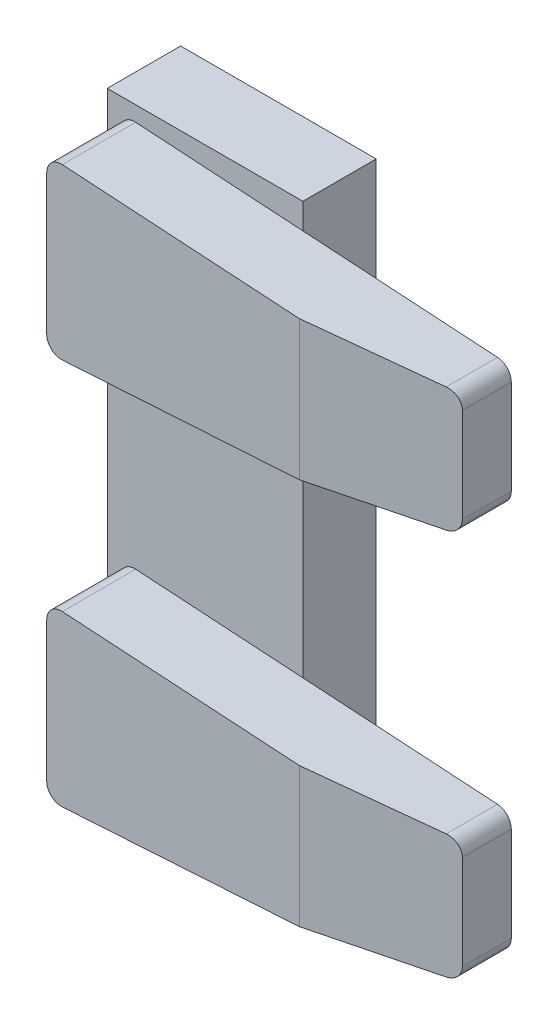
ISO-10303-21;
HEADER;
FILE_DESCRIPTION(('STEP AP214'),'2;1');
FILE_NAME('part.step','',(''),(''),'','','');
FILE_SCHEMA(('AUTOMOTIVE_DESIGN { 1 0 10303 214 1 1 1 1 }'));
ENDSEC;
DATA;
#1=APPLICATION_CONTEXT('core data for automotive mechanical design processes');
#2=APPLICATION_PROTOCOL_DEFINITION('international standard','automotive_design',2000,#1);
#3=PRODUCT_CONTEXT('',#1,'mechanical');
#4=PRODUCT('Part','Part','',(#3));
#5=PRODUCT_RELATED_PRODUCT_CATEGORY('part','',(#4));
#6=PRODUCT_DEFINITION_FORMATION('','',#4);
#7=PRODUCT_DEFINITION_CONTEXT('part definition',#1,'design');
#8=PRODUCT_DEFINITION('design','',#6,#7);
#9=PRODUCT_DEFINITION_SHAPE('','',#8);
#10=(LENGTH_UNIT() NAMED_UNIT(*) SI_UNIT(.MILLI.,.METRE.));
#11=(NAMED_UNIT(*) PLANE_ANGLE_UNIT() SI_UNIT($,.RADIAN.));
#12=(NAMED_UNIT(*) SI_UNIT($,.STERADIAN.) SOLID_ANGLE_UNIT());
#13=UNCERTAINTY_MEASURE_WITH_UNIT(LENGTH_MEASURE(1.E-05),#10,'distance_accuracy_value','');
#14=(GEOMETRIC_REPRESENTATION_CONTEXT(3) GLOBAL_UNCERTAINTY_ASSIGNED_CONTEXT((#13)) GLOBAL_UNIT_ASSIGNED_CONTEXT((#10,
#11,#12)) REPRESENTATION_CONTEXT('',''));
#15=CARTESIAN_POINT('',(0.,0.,0.));
#16=DIRECTION('',(0.,0.,1.));
#17=DIRECTION('',(1.,0.,0.));
#18=AXIS2_PLACEMENT_3D('',#15,#16,#17);
#19=CARTESIAN_POINT('',(37.3650708072044,332.353227073887,30.));
#20=DIRECTION('',(-0.0623782861551806,-0.998052578482889,0.));
#21=DIRECTION('',(0.998052578482889,-0.0623782861551806,0.));
#22=AXIS2_PLACEMENT_3D('',#19,#20,#21);
#23=PLANE('',#22);
#24=DIRECTION('',(-0.998052578482889,0.0623782861551806,0.));
#25=VECTOR('',#24,1.);
#26=CARTESIAN_POINT('',(37.3650708072044,332.353227073887,15.));
#27=LINE('',#26,#25);
#28=CARTESIAN_POINT('',(34.5522056656699,332.529031145233,15.));
#29=VERTEX_POINT('',#28);
#30=CARTESIAN_POINT('',(-39.4477943343301,337.154031145233,15.));
#31=VERTEX_POINT('',#30);
#32=EDGE_CURVE('E152',#29,#31,#27,.T.);
#33=ORIENTED_EDGE('',*,*,#32,.T.);
#34=DIRECTION('',(0.,0.,-1.));
#35=VECTOR('',#34,1.);
#36=CARTESIAN_POINT('',(-39.4477943343301,337.154031145233,30.));
#37=LINE('',#36,#35);
#38=CARTESIAN_POINT('',(-39.4477943343301,337.154031145233,30.));
#39=VERTEX_POINT('',#38);
#40=EDGE_CURVE('E143',#31,#39,#37,.F.);
#41=ORIENTED_EDGE('',*,*,#40,.T.);
#42=DIRECTION('',(-0.998052578482889,0.0623782861551806,0.));
#43=VECTOR('',#42,1.);
#44=CARTESIAN_POINT('',(37.3650708072044,332.353227073887,30.));
#45=LINE('',#44,#43);
#46=CARTESIAN_POINT('',(9.00866170911599,334.125502642518,30.));
#47=VERTEX_POINT('',#46);
#48=EDGE_CURVE('E135',#47,#39,#45,.T.);
#49=ORIENTED_EDGE('',*,*,#48,.F.);
#50=DIRECTION('',(0.982947583285047,-0.0614342239553155,-0.173320179555336));
#51=VECTOR('',#50,1.);
#52=CARTESIAN_POINT('',(29.1853721270141,332.864458241399,26.442301571383));
#53=LINE('',#52,#51);
#54=CARTESIAN_POINT('',(34.5522056656699,332.529031145233,25.4959840175469));
#55=VERTEX_POINT('',#54);
#56=EDGE_CURVE('E120',#47,#55,#53,.T.);
#57=ORIENTED_EDGE('',*,*,#56,.T.);
#58=DIRECTION('',(0.,0.,-1.));
#59=VECTOR('',#58,1.);
#60=CARTESIAN_POINT('',(34.5522056656699,332.529031145233,30.));
#61=LINE('',#60,#59);
#62=EDGE_CURVE('E184',#55,#29,#61,.T.);
#63=ORIENTED_EDGE('',*,*,#62,.T.);
#64=EDGE_LOOP('',(#33,#41,#49,#57,#63));
#65=FACE_BOUND('',#64,.T.);
#66=ADVANCED_FACE('F50',(#65),#23,.F.);
#67=CARTESIAN_POINT('',(-42.6349291927957,337.353227073887,30.));
#68=DIRECTION('',(1.,0.,0.));
#69=DIRECTION('',(0.,0.,-1.));
#70=AXIS2_PLACEMENT_3D('',#67,#68,#69);
#71=PLANE('',#70);
#72=DIRECTION('',(0.,-1.,0.));
#73=VECTOR('',#72,1.);
#74=CARTESIAN_POINT('',(-42.6349291927957,337.353227073887,15.));
#75=LINE('',#74,#73);
#76=CARTESIAN_POINT('',(-42.6349291927957,334.159873409784,15.));
#77=VERTEX_POINT('',#76);
#78=CARTESIAN_POINT('',(-42.6349291927957,305.54658073799,15.));
#79=VERTEX_POINT('',#78);
#80=EDGE_CURVE('E154',#77,#79,#75,.T.);
#81=ORIENTED_EDGE('',*,*,#80,.T.);
#82=DIRECTION('',(0.,0.,-1.));
#83=VECTOR('',#82,1.);
#84=CARTESIAN_POINT('',(-42.6349291927957,305.54658073799,30.));
#85=LINE('',#84,#83);
#86=CARTESIAN_POINT('',(-42.6349291927957,305.54658073799,30.));
#87=VERTEX_POINT('',#86);
#88=EDGE_CURVE('E178',#79,#87,#85,.F.);
#89=ORIENTED_EDGE('',*,*,#88,.T.);
#90=DIRECTION('',(0.,-1.,0.));
#91=VECTOR('',#90,1.);
#92=CARTESIAN_POINT('',(-42.6349291927957,337.353227073887,30.));
#93=LINE('',#92,#91);
#94=CARTESIAN_POINT('',(-42.6349291927957,334.159873409784,30.));
#95=VERTEX_POINT('',#94);
#96=EDGE_CURVE('E144',#95,#87,#93,.T.);
#97=ORIENTED_EDGE('',*,*,#96,.F.);
#98=DIRECTION('',(0.,0.,-1.));
#99=VECTOR('',#98,1.);
#100=CARTESIAN_POINT('',(-42.6349291927957,334.159873409784,30.));
#101=LINE('',#100,#99);
#102=EDGE_CURVE('E175',#95,#77,#101,.T.);
#103=ORIENTED_EDGE('',*,*,#102,.T.);
#104=EDGE_LOOP('',(#81,#89,#97,#103));
#105=FACE_BOUND('',#104,.T.);
#106=ADVANCED_FACE('F206',(#105),#71,.F.);
#107=CARTESIAN_POINT('',(-42.6349291927957,302.353227073887,30.));
#108=DIRECTION('',(-0.0623782861551806,0.998052578482889,0.));
#109=DIRECTION('',(-0.998052578482889,-0.0623782861551806,0.));
#110=AXIS2_PLACEMENT_3D('',#107,#108,#109);
#111=PLANE('',#110);
#112=DIRECTION('',(0.998052578482889,0.0623782861551806,0.));
#113=VECTOR('',#112,1.);
#114=CARTESIAN_POINT('',(-42.6349291927957,302.353227073887,30.));
#115=LINE('',#114,#113);
#116=CARTESIAN_POINT('',(-39.4477943343301,302.552423002541,30.));
#117=VERTEX_POINT('',#116);
#118=CARTESIAN_POINT('',(9.00866170911599,305.580951505257,30.));
#119=VERTEX_POINT('',#118);
#120=EDGE_CURVE('E138',#117,#119,#115,.T.);
#121=ORIENTED_EDGE('',*,*,#120,.F.);
#122=DIRECTION('',(0.,0.,-1.));
#123=VECTOR('',#122,1.);
#124=CARTESIAN_POINT('',(-39.4477943343301,302.552423002541,30.));
#125=LINE('',#124,#123);
#126=CARTESIAN_POINT('',(-39.4477943343301,302.552423002541,15.));
#127=VERTEX_POINT('',#126);
#128=EDGE_CURVE('E164',#117,#127,#125,.T.);
#129=ORIENTED_EDGE('',*,*,#128,.T.);
#130=DIRECTION('',(0.998052578482889,0.0623782861551806,0.));
#131=VECTOR('',#130,1.);
#132=CARTESIAN_POINT('',(-42.6349291927957,302.353227073887,15.));
#133=LINE('',#132,#131);
#134=CARTESIAN_POINT('',(34.5522056656699,307.177423002541,15.));
#135=VERTEX_POINT('',#134);
#136=EDGE_CURVE('E148',#127,#135,#133,.T.);
#137=ORIENTED_EDGE('',*,*,#136,.T.);
#138=DIRECTION('',(0.,0.,-1.));
#139=VECTOR('',#138,1.);
#140=CARTESIAN_POINT('',(34.5522056656699,307.177423002541,30.));
#141=LINE('',#140,#139);
#142=CARTESIAN_POINT('',(34.5522056656699,307.177423002541,25.4959840175469));
#143=VERTEX_POINT('',#142);
#144=EDGE_CURVE('E162',#135,#143,#141,.F.);
#145=ORIENTED_EDGE('',*,*,#144,.T.);
#146=DIRECTION('',(-0.982947583285047,-0.0614342239553155,0.173320179555336));
#147=VECTOR('',#146,1.);
#148=CARTESIAN_POINT('',(-9.44433969001386,304.427638917811,33.2537620217177));
#149=LINE('',#148,#147);
#150=EDGE_CURVE('E160',#143,#119,#149,.T.);
#151=ORIENTED_EDGE('',*,*,#150,.T.);
#152=EDGE_LOOP('',(#121,#129,#137,#145,#151));
#153=FACE_BOUND('',#152,.T.);
#154=ADVANCED_FACE('F213',(#153),#111,.F.);
#155=CARTESIAN_POINT('',(37.3650708072044,307.353227073887,30.));
#156=DIRECTION('',(-1.,0.,0.));
#157=DIRECTION('',(0.,0.,1.));
#158=AXIS2_PLACEMENT_3D('',#155,#156,#157);
#159=PLANE('',#158);
#160=DIRECTION('',(0.,1.,0.));
#161=VECTOR('',#160,1.);
#162=CARTESIAN_POINT('',(37.3650708072044,307.353227073887,15.));
#163=LINE('',#162,#161);
#164=CARTESIAN_POINT('',(37.3650708072044,310.17158073799,15.));
#165=VERTEX_POINT('',#164);
#166=CARTESIAN_POINT('',(37.3650708072044,329.534873409784,15.));
#167=VERTEX_POINT('',#166);
#168=EDGE_CURVE('E145',#165,#167,#163,.T.);
#169=ORIENTED_EDGE('',*,*,#168,.T.);
#170=DIRECTION('',(0.,0.,-1.));
#171=VECTOR('',#170,1.);
#172=CARTESIAN_POINT('',(37.3650708072044,329.534873409784,30.));
#173=LINE('',#172,#171);
#174=CARTESIAN_POINT('',(37.3650708072044,329.534873409784,25.));
#175=VERTEX_POINT('',#174);
#176=EDGE_CURVE('E71',#167,#175,#173,.F.);
#177=ORIENTED_EDGE('',*,*,#176,.T.);
#178=DIRECTION('',(0.,-1.,0.));
#179=VECTOR('',#178,1.);
#180=CARTESIAN_POINT('',(37.3650708072044,307.353227073887,25.));
#181=LINE('',#180,#179);
#182=CARTESIAN_POINT('',(37.3650708072044,310.17158073799,25.));
#183=VERTEX_POINT('',#182);
#184=EDGE_CURVE('E129',#175,#183,#181,.T.);
#185=ORIENTED_EDGE('',*,*,#184,.T.);
#186=DIRECTION('',(0.,0.,-1.));
#187=VECTOR('',#186,1.);
#188=CARTESIAN_POINT('',(37.3650708072044,310.17158073799,30.));
#189=LINE('',#188,#187);
#190=EDGE_CURVE('E187',#183,#165,#189,.T.);
#191=ORIENTED_EDGE('',*,*,#190,.T.);
#192=EDGE_LOOP('',(#169,#177,#185,#191));
#193=FACE_BOUND('',#192,.T.);
#194=ADVANCED_FACE('F192',(#193),#159,.F.);
#195=CARTESIAN_POINT('',(0.,0.,30.));
#196=DIRECTION('',(0.,0.,1.));
#197=DIRECTION('',(1.,0.,0.));
#198=AXIS2_PLACEMENT_3D('',#195,#196,#197);
#199=PLANE('',#198);
#200=ORIENTED_EDGE('',*,*,#96,.T.);
#201=CARTESIAN_POINT('',(-39.6349291927957,305.54658073799,30.));
#202=DIRECTION('',(0.,0.,1.));
#203=DIRECTION('',(1.,0.,0.));
#204=AXIS2_PLACEMENT_3D('',#201,#202,#203);
#205=CIRCLE('',#204,3.);
#206=EDGE_CURVE('E182',#87,#117,#205,.T.);
#207=ORIENTED_EDGE('',*,*,#206,.T.);
#208=ORIENTED_EDGE('',*,*,#120,.T.);
#209=DIRECTION('',(0.,1.,0.));
#210=VECTOR('',#209,1.);
#211=CARTESIAN_POINT('',(9.00866170911599,332.353227073887,30.));
#212=LINE('',#211,#210);
#213=EDGE_CURVE('E123',#119,#47,#212,.T.);
#214=ORIENTED_EDGE('',*,*,#213,.T.);
#215=ORIENTED_EDGE('',*,*,#48,.T.);
#216=CARTESIAN_POINT('',(-39.6349291927957,334.159873409784,30.));
#217=DIRECTION('',(0.,0.,1.));
#218=DIRECTION('',(1.,0.,0.));
#219=AXIS2_PLACEMENT_3D('',#216,#217,#218);
#220=CIRCLE('',#219,3.);
#221=EDGE_CURVE('E180',#39,#95,#220,.T.);
#222=ORIENTED_EDGE('',*,*,#221,.T.);
#223=EDGE_LOOP('',(#200,#207,#208,#214,#215,#222));
#224=FACE_BOUND('',#223,.T.);
#225=ADVANCED_FACE('F134',(#224),#199,.T.);
#226=CARTESIAN_POINT('',(0.,0.,15.));
#227=DIRECTION('',(0.,0.,1.));
#228=DIRECTION('',(1.,0.,0.));
#229=AXIS2_PLACEMENT_3D('',#226,#227,#228);
#230=PLANE('',#229);
#231=ORIENTED_EDGE('',*,*,#136,.F.);
#232=CARTESIAN_POINT('',(-39.6349291927957,305.54658073799,15.));
#233=DIRECTION('',(0.,0.,1.));
#234=DIRECTION('',(1.,0.,0.));
#235=AXIS2_PLACEMENT_3D('',#232,#233,#234);
#236=CIRCLE('',#235,3.);
#237=EDGE_CURVE('E173',#127,#79,#236,.F.);
#238=ORIENTED_EDGE('',*,*,#237,.T.);
#239=ORIENTED_EDGE('',*,*,#80,.F.);
#240=CARTESIAN_POINT('',(-39.6349291927957,334.159873409784,15.));
#241=DIRECTION('',(0.,0.,1.));
#242=DIRECTION('',(1.,0.,0.));
#243=AXIS2_PLACEMENT_3D('',#240,#241,#242);
#244=CIRCLE('',#243,3.);
#245=EDGE_CURVE('E171',#77,#31,#244,.F.);
#246=ORIENTED_EDGE('',*,*,#245,.T.);
#247=ORIENTED_EDGE('',*,*,#32,.F.);
#248=CARTESIAN_POINT('',(34.3650708072044,329.534873409784,15.));
#249=DIRECTION('',(0.,0.,1.));
#250=DIRECTION('',(1.,0.,0.));
#251=AXIS2_PLACEMENT_3D('',#248,#249,#250);
#252=CIRCLE('',#251,3.);
#253=EDGE_CURVE('E169',#29,#167,#252,.F.);
#254=ORIENTED_EDGE('',*,*,#253,.T.);
#255=ORIENTED_EDGE('',*,*,#168,.F.);
#256=CARTESIAN_POINT('',(34.3650708072044,310.17158073799,15.));
#257=DIRECTION('',(0.,0.,1.));
#258=DIRECTION('',(1.,0.,0.));
#259=AXIS2_PLACEMENT_3D('',#256,#257,#258);
#260=CIRCLE('',#259,3.);
#261=EDGE_CURVE('E167',#165,#135,#260,.F.);
#262=ORIENTED_EDGE('',*,*,#261,.T.);
#263=EDGE_LOOP('',(#231,#238,#239,#246,#247,#254,#255,#262));
#264=FACE_BOUND('',#263,.T.);
#265=ADVANCED_FACE('F196',(#264),#230,.F.);
#266=CARTESIAN_POINT('',(9.00866170911599,0.,30.));
#267=DIRECTION('',(0.173648177666932,0.,0.984807753012208));
#268=DIRECTION('',(0.,-1.,0.));
#269=AXIS2_PLACEMENT_3D('',#266,#267,#268);
#270=PLANE('',#269);
#271=ORIENTED_EDGE('',*,*,#184,.F.);
#272=CARTESIAN_POINT('',(34.3650708072044,329.534873409784,25.5289809421254));
#273=DIRECTION('',(0.173648177666932,0.,0.984807753012208));
#274=DIRECTION('',(0.984807753012208,0.,-0.173648177666932));
#275=AXIS2_PLACEMENT_3D('',#272,#273,#274);
#276=ELLIPSE('',#275,3.04627983565724,3.);
#277=EDGE_CURVE('E12',#175,#55,#276,.T.);
#278=ORIENTED_EDGE('',*,*,#277,.T.);
#279=ORIENTED_EDGE('',*,*,#56,.F.);
#280=ORIENTED_EDGE('',*,*,#213,.F.);
#281=ORIENTED_EDGE('',*,*,#150,.F.);
#282=CARTESIAN_POINT('',(34.3650708072044,310.17158073799,25.5289809421254));
#283=DIRECTION('',(0.173648177666932,0.,0.984807753012208));
#284=DIRECTION('',(0.984807753012208,0.,-0.173648177666932));
#285=AXIS2_PLACEMENT_3D('',#282,#283,#284);
#286=ELLIPSE('',#285,3.04627983565724,3.);
#287=EDGE_CURVE('E58',#143,#183,#286,.T.);
#288=ORIENTED_EDGE('',*,*,#287,.T.);
#289=EDGE_LOOP('',(#271,#278,#279,#280,#281,#288));
#290=FACE_BOUND('',#289,.T.);
#291=ADVANCED_FACE('F122',(#290),#270,.T.);
#292=CARTESIAN_POINT('',(-39.6349291927957,305.54658073799,30.));
#293=DIRECTION('',(0.,0.,-1.));
#294=DIRECTION('',(-1.,0.,0.));
#295=AXIS2_PLACEMENT_3D('',#292,#293,#294);
#296=CYLINDRICAL_SURFACE('',#295,3.);
#297=ORIENTED_EDGE('',*,*,#206,.F.);
#298=ORIENTED_EDGE('',*,*,#88,.F.);
#299=ORIENTED_EDGE('',*,*,#237,.F.);
#300=ORIENTED_EDGE('',*,*,#128,.F.);
#301=EDGE_LOOP('',(#297,#298,#299,#300));
#302=FACE_BOUND('',#301,.T.);
#303=ADVANCED_FACE('F210',(#302),#296,.T.);
#304=CARTESIAN_POINT('',(-39.6349291927957,334.159873409784,30.));
#305=DIRECTION('',(0.,0.,-1.));
#306=DIRECTION('',(-1.,0.,0.));
#307=AXIS2_PLACEMENT_3D('',#304,#305,#306);
#308=CYLINDRICAL_SURFACE('',#307,3.);
#309=ORIENTED_EDGE('',*,*,#221,.F.);
#310=ORIENTED_EDGE('',*,*,#40,.F.);
#311=ORIENTED_EDGE('',*,*,#245,.F.);
#312=ORIENTED_EDGE('',*,*,#102,.F.);
#313=EDGE_LOOP('',(#309,#310,#311,#312));
#314=FACE_BOUND('',#313,.T.);
#315=ADVANCED_FACE('F201',(#314),#308,.T.);
#316=CARTESIAN_POINT('',(34.3650708072044,329.534873409784,30.));
#317=DIRECTION('',(0.,0.,-1.));
#318=DIRECTION('',(-1.,0.,0.));
#319=AXIS2_PLACEMENT_3D('',#316,#317,#318);
#320=CYLINDRICAL_SURFACE('',#319,3.);
#321=ORIENTED_EDGE('',*,*,#277,.F.);
#322=ORIENTED_EDGE('',*,*,#176,.F.);
#323=ORIENTED_EDGE('',*,*,#253,.F.);
#324=ORIENTED_EDGE('',*,*,#62,.F.);
#325=EDGE_LOOP('',(#321,#322,#323,#324));
#326=FACE_BOUND('',#325,.T.);
#327=ADVANCED_FACE('F199',(#326),#320,.T.);
#328=CARTESIAN_POINT('',(34.3650708072044,310.17158073799,30.));
#329=DIRECTION('',(0.,0.,-1.));
#330=DIRECTION('',(-1.,0.,0.));
#331=AXIS2_PLACEMENT_3D('',#328,#329,#330);
#332=CYLINDRICAL_SURFACE('',#331,3.);
#333=ORIENTED_EDGE('',*,*,#287,.F.);
#334=ORIENTED_EDGE('',*,*,#144,.F.);
#335=ORIENTED_EDGE('',*,*,#261,.F.);
#336=ORIENTED_EDGE('',*,*,#190,.F.);
#337=EDGE_LOOP('',(#333,#334,#335,#336));
#338=FACE_BOUND('',#337,.T.);
#339=ADVANCED_FACE('F52',(#338),#332,.T.);
#340=CLOSED_SHELL('',(#66,#106,#154,#194,#225,#265,#291,#303,#315,#327,#339));
#341=MANIFOLD_SOLID_BREP('B2',#340);
#342=CARTESIAN_POINT('',(37.3650708072044,253.205318026033,30.));
#343=DIRECTION('',(-0.0623782861551806,-0.998052578482889,0.));
#344=DIRECTION('',(0.998052578482889,-0.0623782861551806,0.));
#345=AXIS2_PLACEMENT_3D('',#342,#343,#344);
#346=PLANE('',#345);
#347=DIRECTION('',(-0.998052578482889,0.0623782861551806,0.));
#348=VECTOR('',#347,1.);
#349=CARTESIAN_POINT('',(37.3650708072044,253.205318026033,15.));
#350=LINE('',#349,#348);
#351=CARTESIAN_POINT('',(34.5522056656699,253.381122097379,15.));
#352=VERTEX_POINT('',#351);
#353=CARTESIAN_POINT('',(-39.4477943343301,258.006122097379,15.));
#354=VERTEX_POINT('',#353);
#355=EDGE_CURVE('E420',#352,#354,#350,.T.);
#356=ORIENTED_EDGE('',*,*,#355,.T.);
#357=DIRECTION('',(0.,0.,-1.));
#358=VECTOR('',#357,1.);
#359=CARTESIAN_POINT('',(-39.4477943343301,258.006122097379,30.));
#360=LINE('',#359,#358);
#361=CARTESIAN_POINT('',(-39.4477943343301,258.006122097379,30.));
#362=VERTEX_POINT('',#361);
#363=EDGE_CURVE('E410',#354,#362,#360,.F.);
#364=ORIENTED_EDGE('',*,*,#363,.T.);
#365=DIRECTION('',(-0.998052578482889,0.0623782861551806,0.));
#366=VECTOR('',#365,1.);
#367=CARTESIAN_POINT('',(37.3650708072044,253.205318026033,30.));
#368=LINE('',#367,#366);
#369=CARTESIAN_POINT('',(9.00866170911599,254.977593594664,30.));
#370=VERTEX_POINT('',#369);
#371=EDGE_CURVE('E403',#370,#362,#368,.T.);
#372=ORIENTED_EDGE('',*,*,#371,.F.);
#373=DIRECTION('',(0.982947583285047,-0.0614342239553155,-0.173320179555336));
#374=VECTOR('',#373,1.);
#375=CARTESIAN_POINT('',(24.405897263794,254.015266372496,27.2850519433866));
#376=LINE('',#375,#374);
#377=CARTESIAN_POINT('',(34.5522056656699,253.381122097379,25.4959840175469));
#378=VERTEX_POINT('',#377);
#379=EDGE_CURVE('E388',#370,#378,#376,.T.);
#380=ORIENTED_EDGE('',*,*,#379,.T.);
#381=DIRECTION('',(0.,0.,-1.));
#382=VECTOR('',#381,1.);
#383=CARTESIAN_POINT('',(34.5522056656699,253.381122097379,30.));
#384=LINE('',#383,#382);
#385=EDGE_CURVE('E443',#378,#352,#384,.T.);
#386=ORIENTED_EDGE('',*,*,#385,.T.);
#387=EDGE_LOOP('',(#356,#364,#372,#380,#386));
#388=FACE_BOUND('',#387,.T.);
#389=ADVANCED_FACE('F318',(#388),#346,.F.);
#390=CARTESIAN_POINT('',(-42.6349291927956,258.205318026033,30.));
#391=DIRECTION('',(1.,0.,0.));
#392=DIRECTION('',(0.,0.,-1.));
#393=AXIS2_PLACEMENT_3D('',#390,#391,#392);
#394=PLANE('',#393);
#395=DIRECTION('',(0.,-1.,0.));
#396=VECTOR('',#395,1.);
#397=CARTESIAN_POINT('',(-42.6349291927956,258.205318026033,30.));
#398=LINE('',#397,#396);
#399=CARTESIAN_POINT('',(-42.6349291927956,255.01196436193,30.));
#400=VERTEX_POINT('',#399);
#401=CARTESIAN_POINT('',(-42.6349291927956,226.398671690136,30.));
#402=VERTEX_POINT('',#401);
#403=EDGE_CURVE('E411',#400,#402,#398,.T.);
#404=ORIENTED_EDGE('',*,*,#403,.F.);
#405=DIRECTION('',(0.,0.,-1.));
#406=VECTOR('',#405,1.);
#407=CARTESIAN_POINT('',(-42.6349291927956,255.01196436193,30.));
#408=LINE('',#407,#406);
#409=CARTESIAN_POINT('',(-42.6349291927956,255.01196436193,15.));
#410=VERTEX_POINT('',#409);
#411=EDGE_CURVE('E432',#400,#410,#408,.T.);
#412=ORIENTED_EDGE('',*,*,#411,.T.);
#413=DIRECTION('',(0.,-1.,0.));
#414=VECTOR('',#413,1.);
#415=CARTESIAN_POINT('',(-42.6349291927956,258.205318026033,15.));
#416=LINE('',#415,#414);
#417=CARTESIAN_POINT('',(-42.6349291927956,226.398671690136,15.));
#418=VERTEX_POINT('',#417);
#419=EDGE_CURVE('E422',#410,#418,#416,.T.);
#420=ORIENTED_EDGE('',*,*,#419,.T.);
#421=DIRECTION('',(0.,0.,-1.));
#422=VECTOR('',#421,1.);
#423=CARTESIAN_POINT('',(-42.6349291927956,226.398671690136,30.));
#424=LINE('',#423,#422);
#425=EDGE_CURVE('E430',#418,#402,#424,.F.);
#426=ORIENTED_EDGE('',*,*,#425,.T.);
#427=EDGE_LOOP('',(#404,#412,#420,#426));
#428=FACE_BOUND('',#427,.T.);
#429=ADVANCED_FACE('F474',(#428),#394,.F.);
#430=CARTESIAN_POINT('',(-42.6349291927956,223.205318026033,30.));
#431=DIRECTION('',(-0.0623782861551802,0.998052578482889,0.));
#432=DIRECTION('',(-0.998052578482889,-0.0623782861551802,0.));
#433=AXIS2_PLACEMENT_3D('',#430,#431,#432);
#434=PLANE('',#433);
#435=DIRECTION('',(0.998052578482889,0.0623782861551802,0.));
#436=VECTOR('',#435,1.);
#437=CARTESIAN_POINT('',(-42.6349291927956,223.205318026033,30.));
#438=LINE('',#437,#436);
#439=CARTESIAN_POINT('',(-39.4477943343301,223.404513954687,30.));
#440=VERTEX_POINT('',#439);
#441=CARTESIAN_POINT('',(9.00866170911598,226.433042457403,30.));
#442=VERTEX_POINT('',#441);
#443=EDGE_CURVE('E406',#440,#442,#438,.T.);
#444=ORIENTED_EDGE('',*,*,#443,.F.);
#445=DIRECTION('',(0.,0.,-1.));
#446=VECTOR('',#445,1.);
#447=CARTESIAN_POINT('',(-39.4477943343301,223.404513954687,30.));
#448=LINE('',#447,#446);
#449=CARTESIAN_POINT('',(-39.4477943343301,223.404513954687,15.));
#450=VERTEX_POINT('',#449);
#451=EDGE_CURVE('E452',#440,#450,#448,.T.);
#452=ORIENTED_EDGE('',*,*,#451,.T.);
#453=DIRECTION('',(0.998052578482889,0.0623782861551802,0.));
#454=VECTOR('',#453,1.);
#455=CARTESIAN_POINT('',(-42.6349291927956,223.205318026033,15.));
#456=LINE('',#455,#454);
#457=CARTESIAN_POINT('',(34.5522056656699,228.029513954687,15.));
#458=VERTEX_POINT('',#457);
#459=EDGE_CURVE('E416',#450,#458,#456,.T.);
#460=ORIENTED_EDGE('',*,*,#459,.T.);
#461=DIRECTION('',(0.,0.,-1.));
#462=VECTOR('',#461,1.);
#463=CARTESIAN_POINT('',(34.5522056656699,228.029513954687,30.));
#464=LINE('',#463,#462);
#465=CARTESIAN_POINT('',(34.5522056656699,228.029513954687,25.4959840175469));
#466=VERTEX_POINT('',#465);
#467=EDGE_CURVE('E450',#458,#466,#464,.F.);
#468=ORIENTED_EDGE('',*,*,#467,.T.);
#469=DIRECTION('',(-0.982947583285047,-0.0614342239553151,0.173320179555336));
#470=VECTOR('',#469,1.);
#471=CARTESIAN_POINT('',(-4.66486482679378,225.578447048908,32.4110116497141));
#472=LINE('',#471,#470);
#473=EDGE_CURVE('E428',#466,#442,#472,.T.);
#474=ORIENTED_EDGE('',*,*,#473,.T.);
#475=EDGE_LOOP('',(#444,#452,#460,#468,#474));
#476=FACE_BOUND('',#475,.T.);
#477=ADVANCED_FACE('F480',(#476),#434,.F.);
#478=CARTESIAN_POINT('',(37.3650708072044,228.205318026033,30.));
#479=DIRECTION('',(-1.,0.,0.));
#480=DIRECTION('',(0.,-1.,0.));
#481=AXIS2_PLACEMENT_3D('',#478,#479,#480);
#482=PLANE('',#481);
#483=DIRECTION('',(0.,-1.,0.));
#484=VECTOR('',#483,1.);
#485=CARTESIAN_POINT('',(37.3650708072044,228.205318026033,25.));
#486=LINE('',#485,#484);
#487=CARTESIAN_POINT('',(37.3650708072044,250.38696436193,25.));
#488=VERTEX_POINT('',#487);
#489=CARTESIAN_POINT('',(37.3650708072044,231.023671690136,25.));
#490=VERTEX_POINT('',#489);
#491=EDGE_CURVE('E397',#488,#490,#486,.T.);
#492=ORIENTED_EDGE('',*,*,#491,.T.);
#493=DIRECTION('',(0.,0.,-1.));
#494=VECTOR('',#493,1.);
#495=CARTESIAN_POINT('',(37.3650708072044,231.023671690136,30.));
#496=LINE('',#495,#494);
#497=CARTESIAN_POINT('',(37.3650708072044,231.023671690136,15.));
#498=VERTEX_POINT('',#497);
#499=EDGE_CURVE('E456',#490,#498,#496,.T.);
#500=ORIENTED_EDGE('',*,*,#499,.T.);
#501=DIRECTION('',(0.,1.,0.));
#502=VECTOR('',#501,1.);
#503=CARTESIAN_POINT('',(37.3650708072044,228.205318026033,15.));
#504=LINE('',#503,#502);
#505=CARTESIAN_POINT('',(37.3650708072044,250.38696436193,15.));
#506=VERTEX_POINT('',#505);
#507=EDGE_CURVE('E412',#498,#506,#504,.T.);
#508=ORIENTED_EDGE('',*,*,#507,.T.);
#509=DIRECTION('',(0.,0.,-1.));
#510=VECTOR('',#509,1.);
#511=CARTESIAN_POINT('',(37.3650708072044,250.38696436193,30.));
#512=LINE('',#511,#510);
#513=EDGE_CURVE('E338',#506,#488,#512,.F.);
#514=ORIENTED_EDGE('',*,*,#513,.T.);
#515=EDGE_LOOP('',(#492,#500,#508,#514));
#516=FACE_BOUND('',#515,.T.);
#517=ADVANCED_FACE('F460',(#516),#482,.F.);
#518=CARTESIAN_POINT('',(0.,0.,30.));
#519=DIRECTION('',(0.,0.,1.));
#520=DIRECTION('',(1.,0.,0.));
#521=AXIS2_PLACEMENT_3D('',#518,#519,#520);
#522=PLANE('',#521);
#523=ORIENTED_EDGE('',*,*,#371,.T.);
#524=CARTESIAN_POINT('',(-39.6349291927956,255.01196436193,30.));
#525=DIRECTION('',(0.,0.,1.));
#526=DIRECTION('',(1.,0.,0.));
#527=AXIS2_PLACEMENT_3D('',#524,#525,#526);
#528=CIRCLE('',#527,3.);
#529=EDGE_CURVE('E448',#362,#400,#528,.T.);
#530=ORIENTED_EDGE('',*,*,#529,.T.);
#531=ORIENTED_EDGE('',*,*,#403,.T.);
#532=CARTESIAN_POINT('',(-39.6349291927956,226.398671690136,30.));
#533=DIRECTION('',(0.,0.,1.));
#534=DIRECTION('',(1.,0.,0.));
#535=AXIS2_PLACEMENT_3D('',#532,#533,#534);
#536=CIRCLE('',#535,3.);
#537=EDGE_CURVE('E446',#402,#440,#536,.T.);
#538=ORIENTED_EDGE('',*,*,#537,.T.);
#539=ORIENTED_EDGE('',*,*,#443,.T.);
#540=DIRECTION('',(0.,1.,0.));
#541=VECTOR('',#540,1.);
#542=CARTESIAN_POINT('',(9.00866170911598,253.205318026033,30.));
#543=LINE('',#542,#541);
#544=EDGE_CURVE('E391',#442,#370,#543,.T.);
#545=ORIENTED_EDGE('',*,*,#544,.T.);
#546=EDGE_LOOP('',(#523,#530,#531,#538,#539,#545));
#547=FACE_BOUND('',#546,.T.);
#548=ADVANCED_FACE('F402',(#547),#522,.T.);
#549=CARTESIAN_POINT('',(0.,0.,15.));
#550=DIRECTION('',(0.,0.,1.));
#551=DIRECTION('',(1.,0.,0.));
#552=AXIS2_PLACEMENT_3D('',#549,#550,#551);
#553=PLANE('',#552);
#554=ORIENTED_EDGE('',*,*,#419,.F.);
#555=CARTESIAN_POINT('',(-39.6349291927956,255.01196436193,15.));
#556=DIRECTION('',(0.,0.,1.));
#557=DIRECTION('',(1.,0.,0.));
#558=AXIS2_PLACEMENT_3D('',#555,#556,#557);
#559=CIRCLE('',#558,3.);
#560=EDGE_CURVE('E441',#410,#354,#559,.F.);
#561=ORIENTED_EDGE('',*,*,#560,.T.);
#562=ORIENTED_EDGE('',*,*,#355,.F.);
#563=CARTESIAN_POINT('',(34.3650708072044,250.38696436193,15.));
#564=DIRECTION('',(0.,0.,1.));
#565=DIRECTION('',(1.,0.,0.));
#566=AXIS2_PLACEMENT_3D('',#563,#564,#565);
#567=CIRCLE('',#566,3.);
#568=EDGE_CURVE('E435',#352,#506,#567,.F.);
#569=ORIENTED_EDGE('',*,*,#568,.T.);
#570=ORIENTED_EDGE('',*,*,#507,.F.);
#571=CARTESIAN_POINT('',(34.3650708072044,231.023671690136,15.));
#572=DIRECTION('',(0.,0.,1.));
#573=DIRECTION('',(1.,0.,0.));
#574=AXIS2_PLACEMENT_3D('',#571,#572,#573);
#575=CIRCLE('',#574,3.);
#576=EDGE_CURVE('E437',#498,#458,#575,.F.);
#577=ORIENTED_EDGE('',*,*,#576,.T.);
#578=ORIENTED_EDGE('',*,*,#459,.F.);
#579=CARTESIAN_POINT('',(-39.6349291927956,226.398671690136,15.));
#580=DIRECTION('',(0.,0.,1.));
#581=DIRECTION('',(1.,0.,0.));
#582=AXIS2_PLACEMENT_3D('',#579,#580,#581);
#583=CIRCLE('',#582,3.);
#584=EDGE_CURVE('E439',#450,#418,#583,.F.);
#585=ORIENTED_EDGE('',*,*,#584,.T.);
#586=EDGE_LOOP('',(#554,#561,#562,#569,#570,#577,#578,#585));
#587=FACE_BOUND('',#586,.T.);
#588=ADVANCED_FACE('F464',(#587),#553,.F.);
#589=CARTESIAN_POINT('',(9.00866170911591,0.,30.));
#590=DIRECTION('',(0.173648177666931,0.,0.984807753012208));
#591=DIRECTION('',(0.,-1.,0.));
#592=AXIS2_PLACEMENT_3D('',#589,#590,#591);
#593=PLANE('',#592);
#594=ORIENTED_EDGE('',*,*,#473,.F.);
#595=CARTESIAN_POINT('',(34.3650708072044,231.023671690136,25.5289809421254));
#596=DIRECTION('',(0.173648177666931,0.,0.984807753012208));
#597=DIRECTION('',(0.984807753012208,0.,-0.173648177666931));
#598=AXIS2_PLACEMENT_3D('',#595,#596,#597);
#599=ELLIPSE('',#598,3.04627983565724,3.);
#600=EDGE_CURVE('E48',#466,#490,#599,.T.);
#601=ORIENTED_EDGE('',*,*,#600,.T.);
#602=ORIENTED_EDGE('',*,*,#491,.F.);
#603=CARTESIAN_POINT('',(34.3650708072044,250.38696436193,25.5289809421254));
#604=DIRECTION('',(0.173648177666931,0.,0.984807753012208));
#605=DIRECTION('',(0.984807753012208,0.,-0.173648177666931));
#606=AXIS2_PLACEMENT_3D('',#603,#604,#605);
#607=ELLIPSE('',#606,3.04627983565724,3.);
#608=EDGE_CURVE('E326',#488,#378,#607,.T.);
#609=ORIENTED_EDGE('',*,*,#608,.T.);
#610=ORIENTED_EDGE('',*,*,#379,.F.);
#611=ORIENTED_EDGE('',*,*,#544,.F.);
#612=EDGE_LOOP('',(#594,#601,#602,#609,#610,#611));
#613=FACE_BOUND('',#612,.T.);
#614=ADVANCED_FACE('F390',(#613),#593,.T.);
#615=CARTESIAN_POINT('',(-39.6349291927956,255.01196436193,30.));
#616=DIRECTION('',(0.,0.,-1.));
#617=DIRECTION('',(-1.,0.,0.));
#618=AXIS2_PLACEMENT_3D('',#615,#616,#617);
#619=CYLINDRICAL_SURFACE('',#618,3.);
#620=ORIENTED_EDGE('',*,*,#529,.F.);
#621=ORIENTED_EDGE('',*,*,#363,.F.);
#622=ORIENTED_EDGE('',*,*,#560,.F.);
#623=ORIENTED_EDGE('',*,*,#411,.F.);
#624=EDGE_LOOP('',(#620,#621,#622,#623));
#625=FACE_BOUND('',#624,.T.);
#626=ADVANCED_FACE('F469',(#625),#619,.T.);
#627=CARTESIAN_POINT('',(-39.6349291927956,226.398671690136,30.));
#628=DIRECTION('',(0.,0.,-1.));
#629=DIRECTION('',(-1.,0.,0.));
#630=AXIS2_PLACEMENT_3D('',#627,#628,#629);
#631=CYLINDRICAL_SURFACE('',#630,3.);
#632=ORIENTED_EDGE('',*,*,#537,.F.);
#633=ORIENTED_EDGE('',*,*,#425,.F.);
#634=ORIENTED_EDGE('',*,*,#584,.F.);
#635=ORIENTED_EDGE('',*,*,#451,.F.);
#636=EDGE_LOOP('',(#632,#633,#634,#635));
#637=FACE_BOUND('',#636,.T.);
#638=ADVANCED_FACE('F477',(#637),#631,.T.);
#639=CARTESIAN_POINT('',(34.3650708072044,231.023671690136,30.));
#640=DIRECTION('',(0.,0.,-1.));
#641=DIRECTION('',(-1.,0.,0.));
#642=AXIS2_PLACEMENT_3D('',#639,#640,#641);
#643=CYLINDRICAL_SURFACE('',#642,3.);
#644=ORIENTED_EDGE('',*,*,#600,.F.);
#645=ORIENTED_EDGE('',*,*,#467,.F.);
#646=ORIENTED_EDGE('',*,*,#576,.F.);
#647=ORIENTED_EDGE('',*,*,#499,.F.);
#648=EDGE_LOOP('',(#644,#645,#646,#647));
#649=FACE_BOUND('',#648,.T.);
#650=ADVANCED_FACE('F482',(#649),#643,.T.);
#651=CARTESIAN_POINT('',(34.3650708072044,250.38696436193,30.));
#652=DIRECTION('',(0.,0.,-1.));
#653=DIRECTION('',(-1.,0.,0.));
#654=AXIS2_PLACEMENT_3D('',#651,#652,#653);
#655=CYLINDRICAL_SURFACE('',#654,3.);
#656=ORIENTED_EDGE('',*,*,#608,.F.);
#657=ORIENTED_EDGE('',*,*,#513,.F.);
#658=ORIENTED_EDGE('',*,*,#568,.F.);
#659=ORIENTED_EDGE('',*,*,#385,.F.);
#660=EDGE_LOOP('',(#656,#657,#658,#659));
#661=FACE_BOUND('',#660,.T.);
#662=ADVANCED_FACE('F320',(#661),#655,.T.);
#663=CLOSED_SHELL('',(#389,#429,#477,#517,#548,#588,#614,#626,#638,#650,#662));
#664=MANIFOLD_SOLID_BREP('B6',#663);
#665=CARTESIAN_POINT('',(-5.25044302958151,220.259815550037,15.));
#666=DIRECTION('',(-1.,0.,0.));
#667=DIRECTION('',(0.,0.,1.));
#668=AXIS2_PLACEMENT_3D('',#665,#666,#667);
#669=PLANE('',#668);
#670=DIRECTION('',(0.,1.,0.));
#671=VECTOR('',#670,1.);
#672=CARTESIAN_POINT('',(-5.25044302958151,220.259815550037,0.));
#673=LINE('',#672,#671);
#674=CARTESIAN_POINT('',(-5.25044302958151,220.259815550037,0.));
#675=VERTEX_POINT('',#674);
#676=CARTESIAN_POINT('',(-5.25044302958151,340.259815550038,0.));
#677=VERTEX_POINT('',#676);
#678=EDGE_CURVE('E635',#675,#677,#673,.T.);
#679=ORIENTED_EDGE('',*,*,#678,.T.);
#680=DIRECTION('',(0.,0.,-1.));
#681=VECTOR('',#680,1.);
#682=CARTESIAN_POINT('',(-5.25044302958151,340.259815550038,15.));
#683=LINE('',#682,#681);
#684=CARTESIAN_POINT('',(-5.25044302958151,340.259815550038,15.));
#685=VERTEX_POINT('',#684);
#686=EDGE_CURVE('E316',#685,#677,#683,.T.);
#687=ORIENTED_EDGE('',*,*,#686,.F.);
#688=DIRECTION('',(0.,1.,0.));
#689=VECTOR('',#688,1.);
#690=CARTESIAN_POINT('',(-5.25044302958151,220.259815550037,15.));
#691=LINE('',#690,#689);
#692=CARTESIAN_POINT('',(-5.25044302958151,220.259815550037,15.));
#693=VERTEX_POINT('',#692);
#694=EDGE_CURVE('E623',#693,#685,#691,.T.);
#695=ORIENTED_EDGE('',*,*,#694,.F.);
#696=DIRECTION('',(0.,0.,-1.));
#697=VECTOR('',#696,1.);
#698=CARTESIAN_POINT('',(-5.25044302958151,220.259815550037,15.));
#699=LINE('',#698,#697);
#700=EDGE_CURVE('E631',#693,#675,#699,.T.);
#701=ORIENTED_EDGE('',*,*,#700,.T.);
#702=EDGE_LOOP('',(#679,#687,#695,#701));
#703=FACE_BOUND('',#702,.T.);
#704=ADVANCED_FACE('F572',(#703),#669,.F.);
#705=CARTESIAN_POINT('',(-45.2504430295815,340.259815550038,15.));
#706=DIRECTION('',(0.,-1.,0.));
#707=DIRECTION('',(0.,0.,-1.));
#708=AXIS2_PLACEMENT_3D('',#705,#706,#707);
#709=PLANE('',#708);
#710=DIRECTION('',(-1.,0.,0.));
#711=VECTOR('',#710,1.);
#712=CARTESIAN_POINT('',(-45.2504430295815,340.259815550038,0.));
#713=LINE('',#712,#711);
#714=CARTESIAN_POINT('',(-45.2504430295815,340.259815550038,0.));
#715=VERTEX_POINT('',#714);
#716=EDGE_CURVE('E627',#677,#715,#713,.T.);
#717=ORIENTED_EDGE('',*,*,#716,.T.);
#718=DIRECTION('',(0.,0.,-1.));
#719=VECTOR('',#718,1.);
#720=CARTESIAN_POINT('',(-45.2504430295815,340.259815550038,15.));
#721=LINE('',#720,#719);
#722=CARTESIAN_POINT('',(-45.2504430295815,340.259815550038,15.));
#723=VERTEX_POINT('',#722);
#724=EDGE_CURVE('E580',#723,#715,#721,.T.);
#725=ORIENTED_EDGE('',*,*,#724,.F.);
#726=DIRECTION('',(-1.,0.,0.));
#727=VECTOR('',#726,1.);
#728=CARTESIAN_POINT('',(-45.2504430295815,340.259815550038,15.));
#729=LINE('',#728,#727);
#730=EDGE_CURVE('E618',#685,#723,#729,.T.);
#731=ORIENTED_EDGE('',*,*,#730,.F.);
#732=ORIENTED_EDGE('',*,*,#686,.T.);
#733=EDGE_LOOP('',(#717,#725,#731,#732));
#734=FACE_BOUND('',#733,.T.);
#735=ADVANCED_FACE('F626',(#734),#709,.F.);
#736=CARTESIAN_POINT('',(-45.2504430295815,220.259815550037,15.));
#737=DIRECTION('',(1.,0.,0.));
#738=DIRECTION('',(0.,0.,-1.));
#739=AXIS2_PLACEMENT_3D('',#736,#737,#738);
#740=PLANE('',#739);
#741=DIRECTION('',(0.,-1.,0.));
#742=VECTOR('',#741,1.);
#743=CARTESIAN_POINT('',(-45.2504430295815,220.259815550037,0.));
#744=LINE('',#743,#742);
#745=CARTESIAN_POINT('',(-45.2504430295815,220.259815550037,0.));
#746=VERTEX_POINT('',#745);
#747=EDGE_CURVE('E605',#715,#746,#744,.T.);
#748=ORIENTED_EDGE('',*,*,#747,.T.);
#749=DIRECTION('',(0.,0.,-1.));
#750=VECTOR('',#749,1.);
#751=CARTESIAN_POINT('',(-45.2504430295815,220.259815550037,15.));
#752=LINE('',#751,#750);
#753=CARTESIAN_POINT('',(-45.2504430295815,220.259815550037,15.));
#754=VERTEX_POINT('',#753);
#755=EDGE_CURVE('E628',#754,#746,#752,.T.);
#756=ORIENTED_EDGE('',*,*,#755,.F.);
#757=DIRECTION('',(0.,-1.,0.));
#758=VECTOR('',#757,1.);
#759=CARTESIAN_POINT('',(-45.2504430295815,220.259815550037,15.));
#760=LINE('',#759,#758);
#761=EDGE_CURVE('E621',#723,#754,#760,.T.);
#762=ORIENTED_EDGE('',*,*,#761,.F.);
#763=ORIENTED_EDGE('',*,*,#724,.T.);
#764=EDGE_LOOP('',(#748,#756,#762,#763));
#765=FACE_BOUND('',#764,.T.);
#766=ADVANCED_FACE('F629',(#765),#740,.F.);
#767=CARTESIAN_POINT('',(-45.2504430295815,220.259815550037,15.));
#768=DIRECTION('',(0.,1.,0.));
#769=DIRECTION('',(0.,0.,1.));
#770=AXIS2_PLACEMENT_3D('',#767,#768,#769);
#771=PLANE('',#770);
#772=DIRECTION('',(1.,0.,0.));
#773=VECTOR('',#772,1.);
#774=CARTESIAN_POINT('',(-45.2504430295815,220.259815550037,0.));
#775=LINE('',#774,#773);
#776=EDGE_CURVE('E611',#746,#675,#775,.T.);
#777=ORIENTED_EDGE('',*,*,#776,.T.);
#778=ORIENTED_EDGE('',*,*,#700,.F.);
#779=DIRECTION('',(1.,0.,0.));
#780=VECTOR('',#779,1.);
#781=CARTESIAN_POINT('',(-45.2504430295815,220.259815550037,15.));
#782=LINE('',#781,#780);
#783=EDGE_CURVE('E588',#754,#693,#782,.T.);
#784=ORIENTED_EDGE('',*,*,#783,.F.);
#785=ORIENTED_EDGE('',*,*,#755,.T.);
#786=EDGE_LOOP('',(#777,#778,#784,#785));
#787=FACE_BOUND('',#786,.T.);
#788=ADVANCED_FACE('F642',(#787),#771,.F.);
#789=CARTESIAN_POINT('',(0.,0.,15.));
#790=DIRECTION('',(0.,0.,-1.));
#791=DIRECTION('',(-1.,0.,0.));
#792=AXIS2_PLACEMENT_3D('',#789,#790,#791);
#793=PLANE('',#792);
#794=ORIENTED_EDGE('',*,*,#694,.T.);
#795=ORIENTED_EDGE('',*,*,#730,.T.);
#796=ORIENTED_EDGE('',*,*,#761,.T.);
#797=ORIENTED_EDGE('',*,*,#783,.T.);
#798=EDGE_LOOP('',(#794,#795,#796,#797));
#799=FACE_BOUND('',#798,.T.);
#800=ADVANCED_FACE('F619',(#799),#793,.F.);
#801=CARTESIAN_POINT('',(0.,0.,0.));
#802=DIRECTION('',(0.,0.,-1.));
#803=DIRECTION('',(-1.,0.,0.));
#804=AXIS2_PLACEMENT_3D('',#801,#802,#803);
#805=PLANE('',#804);
#806=ORIENTED_EDGE('',*,*,#678,.F.);
#807=ORIENTED_EDGE('',*,*,#776,.F.);
#808=ORIENTED_EDGE('',*,*,#747,.F.);
#809=ORIENTED_EDGE('',*,*,#716,.F.);
#810=EDGE_LOOP('',(#806,#807,#808,#809));
#811=FACE_BOUND('',#810,.T.);
#812=ADVANCED_FACE('F645',(#811),#805,.T.);
#813=CLOSED_SHELL('',(#704,#735,#766,#788,#800,#812));
#814=MANIFOLD_SOLID_BREP('B42',#813);
#815=ADVANCED_BREP_SHAPE_REPRESENTATION('',(#18,#341,#664,#814),#14);
#816=SHAPE_DEFINITION_REPRESENTATION(#9,#815);
ENDSEC;
END-ISO-10303-21;
